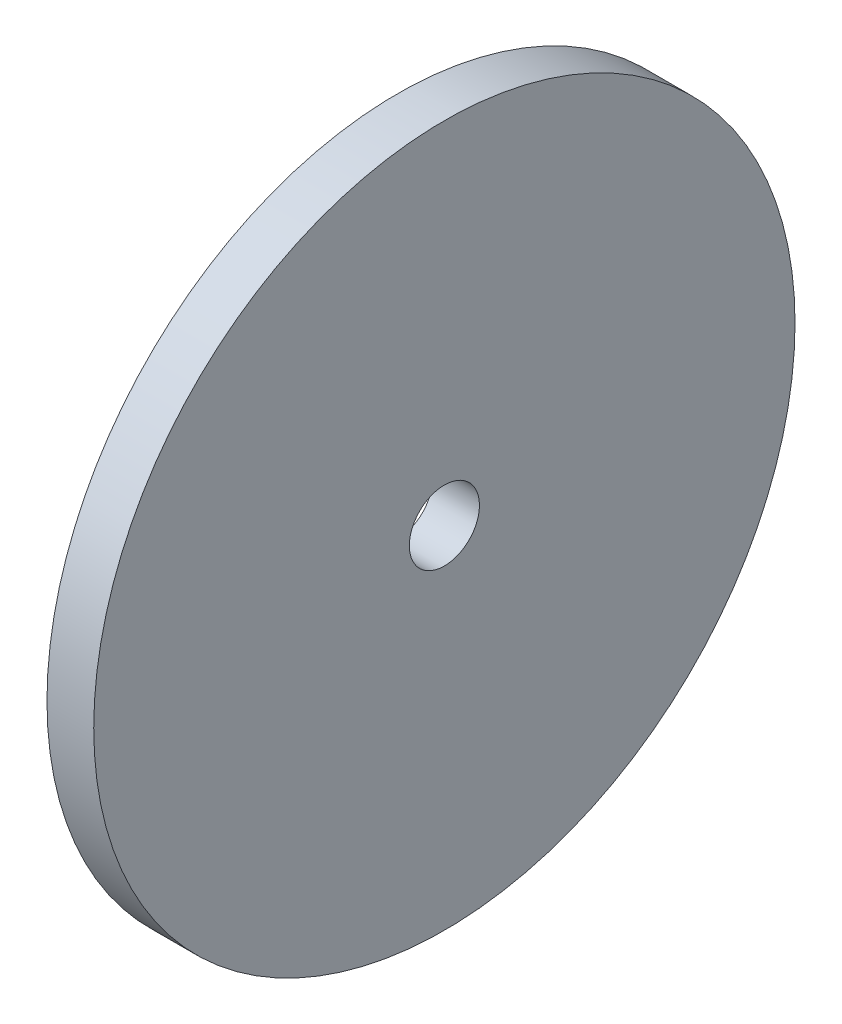
ISO-10303-21;
HEADER;
FILE_DESCRIPTION(('STEP AP214'),'2;1');
FILE_NAME('part.step','',(''),(''),'','','');
FILE_SCHEMA(('AUTOMOTIVE_DESIGN { 1 0 10303 214 1 1 1 1 }'));
ENDSEC;
DATA;
#1=APPLICATION_CONTEXT('core data for automotive mechanical design processes');
#2=APPLICATION_PROTOCOL_DEFINITION('international standard','automotive_design',2000,#1);
#3=PRODUCT_CONTEXT('',#1,'mechanical');
#4=PRODUCT('Part','Part','',(#3));
#5=PRODUCT_RELATED_PRODUCT_CATEGORY('part','',(#4));
#6=PRODUCT_DEFINITION_FORMATION('','',#4);
#7=PRODUCT_DEFINITION_CONTEXT('part definition',#1,'design');
#8=PRODUCT_DEFINITION('design','',#6,#7);
#9=PRODUCT_DEFINITION_SHAPE('','',#8);
#10=(LENGTH_UNIT() NAMED_UNIT(*) SI_UNIT(.MILLI.,.METRE.));
#11=(NAMED_UNIT(*) PLANE_ANGLE_UNIT() SI_UNIT($,.RADIAN.));
#12=(NAMED_UNIT(*) SI_UNIT($,.STERADIAN.) SOLID_ANGLE_UNIT());
#13=UNCERTAINTY_MEASURE_WITH_UNIT(LENGTH_MEASURE(1.E-05),#10,'distance_accuracy_value','');
#14=(GEOMETRIC_REPRESENTATION_CONTEXT(3) GLOBAL_UNCERTAINTY_ASSIGNED_CONTEXT((#13)) GLOBAL_UNIT_ASSIGNED_CONTEXT((#10,
#11,#12)) REPRESENTATION_CONTEXT('',''));
#15=CARTESIAN_POINT('',(0.,0.,0.));
#16=DIRECTION('',(0.,0.,1.));
#17=DIRECTION('',(1.,0.,0.));
#18=AXIS2_PLACEMENT_3D('',#15,#16,#17);
#19=CARTESIAN_POINT('',(2.,0.,0.));
#20=DIRECTION('',(-1.,0.,0.));
#21=DIRECTION('',(0.,0.,1.));
#22=AXIS2_PLACEMENT_3D('',#19,#20,#21);
#23=CYLINDRICAL_SURFACE('',#22,15.);
#24=CARTESIAN_POINT('',(2.,0.,0.));
#25=DIRECTION('',(1.,0.,0.));
#26=DIRECTION('',(0.,0.,-1.));
#27=AXIS2_PLACEMENT_3D('',#24,#25,#26);
#28=CIRCLE('',#27,15.);
#29=CARTESIAN_POINT('',(2.,0.,-15.));
#30=VERTEX_POINT('',#29);
#31=EDGE_CURVE('E10',#30,#30,#28,.T.);
#32=ORIENTED_EDGE('',*,*,#31,.F.);
#33=EDGE_LOOP('',(#32));
#34=FACE_BOUND('',#33,.T.);
#35=CARTESIAN_POINT('',(0.,0.,0.));
#36=DIRECTION('',(1.,0.,0.));
#37=DIRECTION('',(0.,0.,-1.));
#38=AXIS2_PLACEMENT_3D('',#35,#36,#37);
#39=CIRCLE('',#38,15.);
#40=CARTESIAN_POINT('',(0.,0.,-15.));
#41=VERTEX_POINT('',#40);
#42=EDGE_CURVE('E34',#41,#41,#39,.T.);
#43=ORIENTED_EDGE('',*,*,#42,.T.);
#44=EDGE_LOOP('',(#43));
#45=FACE_BOUND('',#44,.T.);
#46=ADVANCED_FACE('F31',(#34,#45),#23,.T.);
#47=CARTESIAN_POINT('',(2.,0.,0.));
#48=DIRECTION('',(1.,0.,0.));
#49=DIRECTION('',(0.,0.,-1.));
#50=AXIS2_PLACEMENT_3D('',#47,#48,#49);
#51=PLANE('',#50);
#52=CARTESIAN_POINT('',(2.,0.,0.));
#53=DIRECTION('',(1.,0.,0.));
#54=DIRECTION('',(0.,0.,-1.));
#55=AXIS2_PLACEMENT_3D('',#52,#53,#54);
#56=CIRCLE('',#55,1.5);
#57=CARTESIAN_POINT('',(2.,0.,-1.5));
#58=VERTEX_POINT('',#57);
#59=EDGE_CURVE('E43',#58,#58,#56,.T.);
#60=ORIENTED_EDGE('',*,*,#59,.F.);
#61=EDGE_LOOP('',(#60));
#62=FACE_BOUND('',#61,.T.);
#63=ORIENTED_EDGE('',*,*,#31,.T.);
#64=EDGE_LOOP('',(#63));
#65=FACE_BOUND('',#64,.T.);
#66=ADVANCED_FACE('F58',(#62,#65),#51,.T.);
#67=CARTESIAN_POINT('',(0.,0.,0.));
#68=DIRECTION('',(1.,0.,0.));
#69=DIRECTION('',(0.,0.,-1.));
#70=AXIS2_PLACEMENT_3D('',#67,#68,#69);
#71=PLANE('',#70);
#72=CARTESIAN_POINT('',(0.,0.,0.));
#73=DIRECTION('',(1.,0.,0.));
#74=DIRECTION('',(0.,0.,-1.));
#75=AXIS2_PLACEMENT_3D('',#72,#73,#74);
#76=CIRCLE('',#75,1.5);
#77=CARTESIAN_POINT('',(0.,0.,-1.5));
#78=VERTEX_POINT('',#77);
#79=EDGE_CURVE('E41',#78,#78,#76,.T.);
#80=ORIENTED_EDGE('',*,*,#79,.T.);
#81=EDGE_LOOP('',(#80));
#82=FACE_BOUND('',#81,.T.);
#83=ORIENTED_EDGE('',*,*,#42,.F.);
#84=EDGE_LOOP('',(#83));
#85=FACE_BOUND('',#84,.T.);
#86=ADVANCED_FACE('F49',(#82,#85),#71,.F.);
#87=CARTESIAN_POINT('',(0.,0.,0.));
#88=DIRECTION('',(1.,0.,0.));
#89=DIRECTION('',(0.,0.,-1.));
#90=AXIS2_PLACEMENT_3D('',#87,#88,#89);
#91=CYLINDRICAL_SURFACE('',#90,1.5);
#92=ORIENTED_EDGE('',*,*,#79,.F.);
#93=EDGE_LOOP('',(#92));
#94=FACE_BOUND('',#93,.T.);
#95=ORIENTED_EDGE('',*,*,#59,.T.);
#96=EDGE_LOOP('',(#95));
#97=FACE_BOUND('',#96,.T.);
#98=ADVANCED_FACE('F52',(#94,#97),#91,.F.);
#99=CLOSED_SHELL('',(#46,#66,#86,#98));
#100=MANIFOLD_SOLID_BREP('B2',#99);
#101=ADVANCED_BREP_SHAPE_REPRESENTATION('',(#18,#100),#14);
#102=SHAPE_DEFINITION_REPRESENTATION(#9,#101);
ENDSEC;
END-ISO-10303-21;
